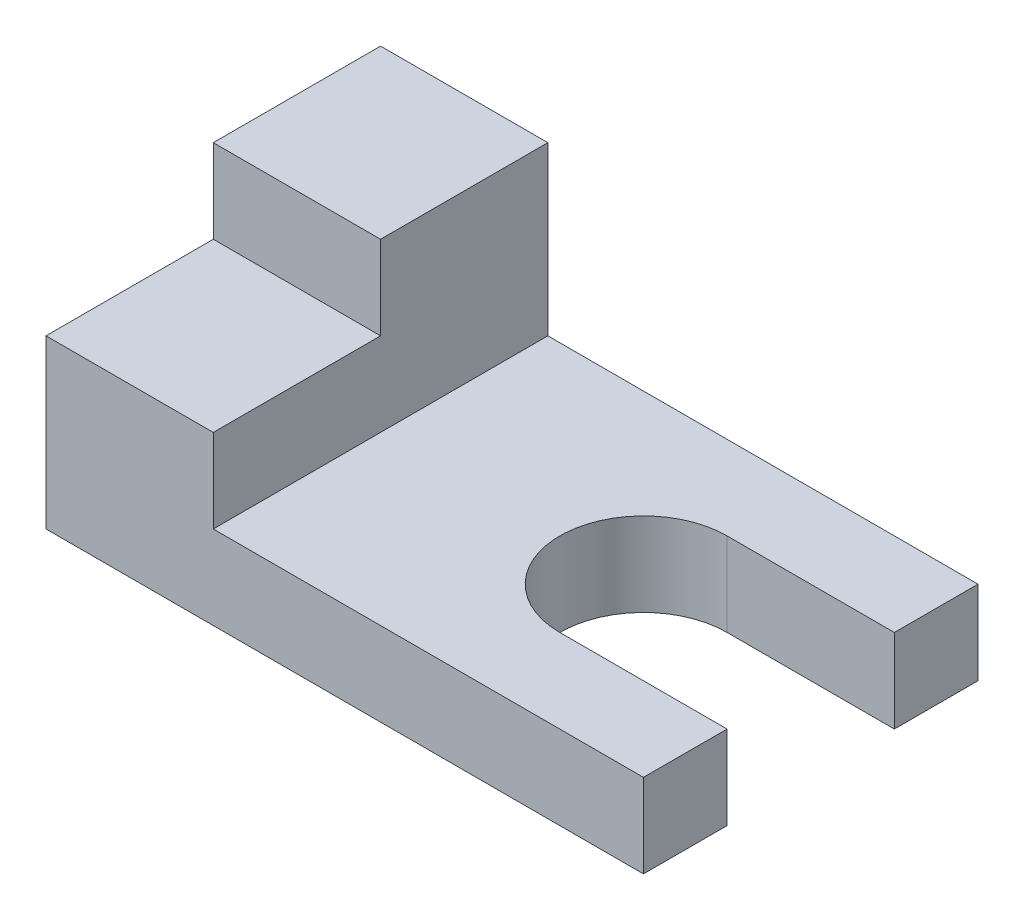
ISO-10303-21;
HEADER;
FILE_DESCRIPTION(('STEP AP214'),'2;1');
FILE_NAME('part.step','',(''),(''),'','','');
FILE_SCHEMA(('AUTOMOTIVE_DESIGN { 1 0 10303 214 1 1 1 1 }'));
ENDSEC;
DATA;
#1=APPLICATION_CONTEXT('core data for automotive mechanical design processes');
#2=APPLICATION_PROTOCOL_DEFINITION('international standard','automotive_design',2000,#1);
#3=PRODUCT_CONTEXT('',#1,'mechanical');
#4=PRODUCT('Part','Part','',(#3));
#5=PRODUCT_RELATED_PRODUCT_CATEGORY('part','',(#4));
#6=PRODUCT_DEFINITION_FORMATION('','',#4);
#7=PRODUCT_DEFINITION_CONTEXT('part definition',#1,'design');
#8=PRODUCT_DEFINITION('design','',#6,#7);
#9=PRODUCT_DEFINITION_SHAPE('','',#8);
#10=(LENGTH_UNIT() NAMED_UNIT(*) SI_UNIT(.MILLI.,.METRE.));
#11=(NAMED_UNIT(*) PLANE_ANGLE_UNIT() SI_UNIT($,.RADIAN.));
#12=(NAMED_UNIT(*) SI_UNIT($,.STERADIAN.) SOLID_ANGLE_UNIT());
#13=UNCERTAINTY_MEASURE_WITH_UNIT(LENGTH_MEASURE(1.E-05),#10,'distance_accuracy_value','');
#14=(GEOMETRIC_REPRESENTATION_CONTEXT(3) GLOBAL_UNCERTAINTY_ASSIGNED_CONTEXT((#13)) GLOBAL_UNIT_ASSIGNED_CONTEXT((#10,
#11,#12)) REPRESENTATION_CONTEXT('',''));
#15=CARTESIAN_POINT('',(0.,0.,0.));
#16=DIRECTION('',(0.,0.,1.));
#17=DIRECTION('',(1.,0.,0.));
#18=AXIS2_PLACEMENT_3D('',#15,#16,#17);
#19=CARTESIAN_POINT('',(0.,0.,28.));
#20=DIRECTION('',(0.,1.,0.));
#21=DIRECTION('',(0.,0.,1.));
#22=AXIS2_PLACEMENT_3D('',#19,#20,#21);
#23=PLANE('',#22);
#24=DIRECTION('',(1.,0.,0.));
#25=VECTOR('',#24,1.);
#26=CARTESIAN_POINT('',(50.,0.,21.));
#27=LINE('',#26,#25);
#28=CARTESIAN_POINT('',(36.,0.,21.));
#29=VERTEX_POINT('',#28);
#30=CARTESIAN_POINT('',(50.,0.,21.));
#31=VERTEX_POINT('',#30);
#32=EDGE_CURVE('E210',#29,#31,#27,.T.);
#33=ORIENTED_EDGE('',*,*,#32,.T.);
#34=DIRECTION('',(0.,0.,-1.));
#35=VECTOR('',#34,1.);
#36=CARTESIAN_POINT('',(50.,0.,28.));
#37=LINE('',#36,#35);
#38=CARTESIAN_POINT('',(50.,0.,28.));
#39=VERTEX_POINT('',#38);
#40=EDGE_CURVE('E41',#39,#31,#37,.T.);
#41=ORIENTED_EDGE('',*,*,#40,.F.);
#42=DIRECTION('',(1.,0.,0.));
#43=VECTOR('',#42,1.);
#44=CARTESIAN_POINT('',(0.,0.,28.));
#45=LINE('',#44,#43);
#46=CARTESIAN_POINT('',(0.,0.,28.));
#47=VERTEX_POINT('',#46);
#48=EDGE_CURVE('E184',#47,#39,#45,.T.);
#49=ORIENTED_EDGE('',*,*,#48,.F.);
#50=DIRECTION('',(0.,0.,-1.));
#51=VECTOR('',#50,1.);
#52=CARTESIAN_POINT('',(0.,0.,28.));
#53=LINE('',#52,#51);
#54=CARTESIAN_POINT('',(0.,0.,0.));
#55=VERTEX_POINT('',#54);
#56=EDGE_CURVE('E11',#47,#55,#53,.T.);
#57=ORIENTED_EDGE('',*,*,#56,.T.);
#58=DIRECTION('',(1.,0.,0.));
#59=VECTOR('',#58,1.);
#60=CARTESIAN_POINT('',(0.,0.,0.));
#61=LINE('',#60,#59);
#62=CARTESIAN_POINT('',(50.,0.,0.));
#63=VERTEX_POINT('',#62);
#64=EDGE_CURVE('E172',#55,#63,#61,.T.);
#65=ORIENTED_EDGE('',*,*,#64,.T.);
#66=CARTESIAN_POINT('',(50.,0.,7.));
#67=VERTEX_POINT('',#66);
#68=EDGE_CURVE('E148',#67,#63,#37,.T.);
#69=ORIENTED_EDGE('',*,*,#68,.F.);
#70=DIRECTION('',(-1.,0.,0.));
#71=VECTOR('',#70,1.);
#72=CARTESIAN_POINT('',(36.,0.,7.));
#73=LINE('',#72,#71);
#74=CARTESIAN_POINT('',(36.,0.,7.));
#75=VERTEX_POINT('',#74);
#76=EDGE_CURVE('E207',#67,#75,#73,.T.);
#77=ORIENTED_EDGE('',*,*,#76,.T.);
#78=CARTESIAN_POINT('',(36.,0.,14.));
#79=DIRECTION('',(0.,1.,0.));
#80=DIRECTION('',(0.,0.,1.));
#81=AXIS2_PLACEMENT_3D('',#78,#79,#80);
#82=CIRCLE('',#81,7.);
#83=EDGE_CURVE('E133',#75,#29,#82,.T.);
#84=ORIENTED_EDGE('',*,*,#83,.T.);
#85=EDGE_LOOP('',(#33,#41,#49,#57,#65,#69,#77,#84));
#86=FACE_BOUND('',#85,.T.);
#87=ADVANCED_FACE('F33',(#86),#23,.F.);
#88=CARTESIAN_POINT('',(50.,0.,28.));
#89=DIRECTION('',(-1.,0.,0.));
#90=DIRECTION('',(0.,0.,1.));
#91=AXIS2_PLACEMENT_3D('',#88,#89,#90);
#92=PLANE('',#91);
#93=DIRECTION('',(0.,-1.,0.));
#94=VECTOR('',#93,1.);
#95=CARTESIAN_POINT('',(50.,21.001,21.));
#96=LINE('',#95,#94);
#97=CARTESIAN_POINT('',(50.,7.,21.));
#98=VERTEX_POINT('',#97);
#99=EDGE_CURVE('E127',#98,#31,#96,.T.);
#100=ORIENTED_EDGE('',*,*,#99,.F.);
#101=DIRECTION('',(0.,0.,-1.));
#102=VECTOR('',#101,1.);
#103=CARTESIAN_POINT('',(50.,7.,28.));
#104=LINE('',#103,#102);
#105=CARTESIAN_POINT('',(50.,7.,28.));
#106=VERTEX_POINT('',#105);
#107=EDGE_CURVE('E141',#106,#98,#104,.T.);
#108=ORIENTED_EDGE('',*,*,#107,.F.);
#109=DIRECTION('',(0.,1.,0.));
#110=VECTOR('',#109,1.);
#111=CARTESIAN_POINT('',(50.,0.,28.));
#112=LINE('',#111,#110);
#113=EDGE_CURVE('E182',#39,#106,#112,.T.);
#114=ORIENTED_EDGE('',*,*,#113,.F.);
#115=ORIENTED_EDGE('',*,*,#40,.T.);
#116=EDGE_LOOP('',(#100,#108,#114,#115));
#117=FACE_BOUND('',#116,.T.);
#118=ADVANCED_FACE('F139',(#117),#92,.F.);
#119=DIRECTION('',(0.,-1.,0.));
#120=VECTOR('',#119,1.);
#121=CARTESIAN_POINT('',(50.,21.001,7.));
#122=LINE('',#121,#120);
#123=CARTESIAN_POINT('',(50.,7.,7.));
#124=VERTEX_POINT('',#123);
#125=EDGE_CURVE('E48',#124,#67,#122,.T.);
#126=ORIENTED_EDGE('',*,*,#125,.T.);
#127=ORIENTED_EDGE('',*,*,#68,.T.);
#128=DIRECTION('',(0.,1.,0.));
#129=VECTOR('',#128,1.);
#130=CARTESIAN_POINT('',(50.,0.,0.));
#131=LINE('',#130,#129);
#132=CARTESIAN_POINT('',(50.,7.,0.));
#133=VERTEX_POINT('',#132);
#134=EDGE_CURVE('E169',#63,#133,#131,.T.);
#135=ORIENTED_EDGE('',*,*,#134,.T.);
#136=EDGE_CURVE('E149',#124,#133,#104,.T.);
#137=ORIENTED_EDGE('',*,*,#136,.F.);
#138=EDGE_LOOP('',(#126,#127,#135,#137));
#139=FACE_BOUND('',#138,.T.);
#140=ADVANCED_FACE('F223',(#139),#92,.F.);
#141=CARTESIAN_POINT('',(14.,7.,28.));
#142=DIRECTION('',(0.,-1.,0.));
#143=DIRECTION('',(0.,0.,-1.));
#144=AXIS2_PLACEMENT_3D('',#141,#142,#143);
#145=PLANE('',#144);
#146=DIRECTION('',(-1.,0.,0.));
#147=VECTOR('',#146,1.);
#148=CARTESIAN_POINT('',(50.,7.,21.));
#149=LINE('',#148,#147);
#150=CARTESIAN_POINT('',(36.,7.,21.));
#151=VERTEX_POINT('',#150);
#152=EDGE_CURVE('E123',#98,#151,#149,.T.);
#153=ORIENTED_EDGE('',*,*,#152,.T.);
#154=CARTESIAN_POINT('',(36.,7.,14.));
#155=DIRECTION('',(0.,-1.,0.));
#156=DIRECTION('',(0.,0.,-1.));
#157=AXIS2_PLACEMENT_3D('',#154,#155,#156);
#158=CIRCLE('',#157,7.);
#159=CARTESIAN_POINT('',(36.,7.,7.));
#160=VERTEX_POINT('',#159);
#161=EDGE_CURVE('E134',#151,#160,#158,.T.);
#162=ORIENTED_EDGE('',*,*,#161,.T.);
#163=DIRECTION('',(1.,0.,0.));
#164=VECTOR('',#163,1.);
#165=CARTESIAN_POINT('',(36.,7.,7.));
#166=LINE('',#165,#164);
#167=EDGE_CURVE('E194',#160,#124,#166,.T.);
#168=ORIENTED_EDGE('',*,*,#167,.T.);
#169=ORIENTED_EDGE('',*,*,#136,.T.);
#170=DIRECTION('',(-1.,0.,0.));
#171=VECTOR('',#170,1.);
#172=CARTESIAN_POINT('',(14.,7.,0.));
#173=LINE('',#172,#171);
#174=CARTESIAN_POINT('',(14.,7.,0.));
#175=VERTEX_POINT('',#174);
#176=EDGE_CURVE('E167',#133,#175,#173,.T.);
#177=ORIENTED_EDGE('',*,*,#176,.T.);
#178=DIRECTION('',(0.,0.,-1.));
#179=VECTOR('',#178,1.);
#180=CARTESIAN_POINT('',(14.,7.,28.));
#181=LINE('',#180,#179);
#182=CARTESIAN_POINT('',(14.,7.,28.));
#183=VERTEX_POINT('',#182);
#184=EDGE_CURVE('E151',#183,#175,#181,.T.);
#185=ORIENTED_EDGE('',*,*,#184,.F.);
#186=DIRECTION('',(-1.,0.,0.));
#187=VECTOR('',#186,1.);
#188=CARTESIAN_POINT('',(14.,7.,28.));
#189=LINE('',#188,#187);
#190=EDGE_CURVE('E147',#106,#183,#189,.T.);
#191=ORIENTED_EDGE('',*,*,#190,.F.);
#192=ORIENTED_EDGE('',*,*,#107,.T.);
#193=EDGE_LOOP('',(#153,#162,#168,#169,#177,#185,#191,#192));
#194=FACE_BOUND('',#193,.T.);
#195=ADVANCED_FACE('F145',(#194),#145,.F.);
#196=CARTESIAN_POINT('',(0.,0.,28.));
#197=DIRECTION('',(0.,0.,-1.));
#198=DIRECTION('',(-1.,0.,0.));
#199=AXIS2_PLACEMENT_3D('',#196,#197,#198);
#200=PLANE('',#199);
#201=DIRECTION('',(1.,0.,0.));
#202=VECTOR('',#201,1.);
#203=CARTESIAN_POINT('',(0.,14.,28.));
#204=LINE('',#203,#202);
#205=CARTESIAN_POINT('',(0.,14.,28.));
#206=VERTEX_POINT('',#205);
#207=CARTESIAN_POINT('',(14.,14.,28.));
#208=VERTEX_POINT('',#207);
#209=EDGE_CURVE('E193',#206,#208,#204,.T.);
#210=ORIENTED_EDGE('',*,*,#209,.F.);
#211=DIRECTION('',(0.,-1.,0.));
#212=VECTOR('',#211,1.);
#213=CARTESIAN_POINT('',(0.,0.,28.));
#214=LINE('',#213,#212);
#215=EDGE_CURVE('E163',#206,#47,#214,.T.);
#216=ORIENTED_EDGE('',*,*,#215,.T.);
#217=ORIENTED_EDGE('',*,*,#48,.T.);
#218=ORIENTED_EDGE('',*,*,#113,.T.);
#219=ORIENTED_EDGE('',*,*,#190,.T.);
#220=DIRECTION('',(0.,1.,0.));
#221=VECTOR('',#220,1.);
#222=CARTESIAN_POINT('',(14.,7.,28.));
#223=LINE('',#222,#221);
#224=EDGE_CURVE('E159',#183,#208,#223,.T.);
#225=ORIENTED_EDGE('',*,*,#224,.T.);
#226=EDGE_LOOP('',(#210,#216,#217,#218,#219,#225));
#227=FACE_BOUND('',#226,.T.);
#228=ADVANCED_FACE('F240',(#227),#200,.F.);
#229=CARTESIAN_POINT('',(0.,0.,28.));
#230=DIRECTION('',(1.,0.,0.));
#231=DIRECTION('',(0.,0.,-1.));
#232=AXIS2_PLACEMENT_3D('',#229,#230,#231);
#233=PLANE('',#232);
#234=DIRECTION('',(0.,0.,1.));
#235=VECTOR('',#234,1.);
#236=CARTESIAN_POINT('',(0.,14.,14.));
#237=LINE('',#236,#235);
#238=CARTESIAN_POINT('',(0.,14.,14.));
#239=VERTEX_POINT('',#238);
#240=EDGE_CURVE('E56',#239,#206,#237,.T.);
#241=ORIENTED_EDGE('',*,*,#240,.F.);
#242=DIRECTION('',(0.,1.,0.));
#243=VECTOR('',#242,1.);
#244=CARTESIAN_POINT('',(0.,14.,14.));
#245=LINE('',#244,#243);
#246=CARTESIAN_POINT('',(0.,21.,14.));
#247=VERTEX_POINT('',#246);
#248=EDGE_CURVE('E178',#239,#247,#245,.T.);
#249=ORIENTED_EDGE('',*,*,#248,.T.);
#250=DIRECTION('',(0.,0.,-1.));
#251=VECTOR('',#250,1.);
#252=CARTESIAN_POINT('',(0.,21.,28.));
#253=LINE('',#252,#251);
#254=CARTESIAN_POINT('',(0.,21.,0.));
#255=VERTEX_POINT('',#254);
#256=EDGE_CURVE('E157',#247,#255,#253,.T.);
#257=ORIENTED_EDGE('',*,*,#256,.T.);
#258=DIRECTION('',(0.,-1.,0.));
#259=VECTOR('',#258,1.);
#260=CARTESIAN_POINT('',(0.,0.,0.));
#261=LINE('',#260,#259);
#262=EDGE_CURVE('E175',#255,#55,#261,.T.);
#263=ORIENTED_EDGE('',*,*,#262,.T.);
#264=ORIENTED_EDGE('',*,*,#56,.F.);
#265=ORIENTED_EDGE('',*,*,#215,.F.);
#266=EDGE_LOOP('',(#241,#249,#257,#263,#264,#265));
#267=FACE_BOUND('',#266,.T.);
#268=ADVANCED_FACE('F35',(#267),#233,.F.);
#269=CARTESIAN_POINT('',(14.,7.,28.));
#270=DIRECTION('',(-1.,0.,0.));
#271=DIRECTION('',(0.,0.,1.));
#272=AXIS2_PLACEMENT_3D('',#269,#270,#271);
#273=PLANE('',#272);
#274=DIRECTION('',(0.,0.,-1.));
#275=VECTOR('',#274,1.);
#276=CARTESIAN_POINT('',(14.,21.,28.));
#277=LINE('',#276,#275);
#278=CARTESIAN_POINT('',(14.,21.,14.));
#279=VERTEX_POINT('',#278);
#280=CARTESIAN_POINT('',(14.,21.,0.));
#281=VERTEX_POINT('',#280);
#282=EDGE_CURVE('E155',#279,#281,#277,.T.);
#283=ORIENTED_EDGE('',*,*,#282,.F.);
#284=DIRECTION('',(0.,1.,0.));
#285=VECTOR('',#284,1.);
#286=CARTESIAN_POINT('',(14.,14.,14.));
#287=LINE('',#286,#285);
#288=CARTESIAN_POINT('',(14.,14.,14.));
#289=VERTEX_POINT('',#288);
#290=EDGE_CURVE('E187',#289,#279,#287,.T.);
#291=ORIENTED_EDGE('',*,*,#290,.F.);
#292=DIRECTION('',(0.,0.,-1.));
#293=VECTOR('',#292,1.);
#294=CARTESIAN_POINT('',(14.,14.,28.));
#295=LINE('',#294,#293);
#296=EDGE_CURVE('E198',#208,#289,#295,.T.);
#297=ORIENTED_EDGE('',*,*,#296,.F.);
#298=ORIENTED_EDGE('',*,*,#224,.F.);
#299=ORIENTED_EDGE('',*,*,#184,.T.);
#300=DIRECTION('',(0.,1.,0.));
#301=VECTOR('',#300,1.);
#302=CARTESIAN_POINT('',(14.,7.,0.));
#303=LINE('',#302,#301);
#304=EDGE_CURVE('E164',#175,#281,#303,.T.);
#305=ORIENTED_EDGE('',*,*,#304,.T.);
#306=EDGE_LOOP('',(#283,#291,#297,#298,#299,#305));
#307=FACE_BOUND('',#306,.T.);
#308=ADVANCED_FACE('F236',(#307),#273,.F.);
#309=CARTESIAN_POINT('',(0.,21.,28.));
#310=DIRECTION('',(0.,-1.,0.));
#311=DIRECTION('',(0.,0.,-1.));
#312=AXIS2_PLACEMENT_3D('',#309,#310,#311);
#313=PLANE('',#312);
#314=ORIENTED_EDGE('',*,*,#256,.F.);
#315=DIRECTION('',(-1.,0.,0.));
#316=VECTOR('',#315,1.);
#317=CARTESIAN_POINT('',(14.,21.,14.));
#318=LINE('',#317,#316);
#319=EDGE_CURVE('E191',#279,#247,#318,.T.);
#320=ORIENTED_EDGE('',*,*,#319,.F.);
#321=ORIENTED_EDGE('',*,*,#282,.T.);
#322=DIRECTION('',(-1.,0.,0.));
#323=VECTOR('',#322,1.);
#324=CARTESIAN_POINT('',(0.,21.,0.));
#325=LINE('',#324,#323);
#326=EDGE_CURVE('E160',#281,#255,#325,.T.);
#327=ORIENTED_EDGE('',*,*,#326,.T.);
#328=EDGE_LOOP('',(#314,#320,#321,#327));
#329=FACE_BOUND('',#328,.T.);
#330=ADVANCED_FACE('F245',(#329),#313,.F.);
#331=CARTESIAN_POINT('',(0.,0.,0.));
#332=DIRECTION('',(0.,0.,-1.));
#333=DIRECTION('',(-1.,0.,0.));
#334=AXIS2_PLACEMENT_3D('',#331,#332,#333);
#335=PLANE('',#334);
#336=ORIENTED_EDGE('',*,*,#262,.F.);
#337=ORIENTED_EDGE('',*,*,#326,.F.);
#338=ORIENTED_EDGE('',*,*,#304,.F.);
#339=ORIENTED_EDGE('',*,*,#176,.F.);
#340=ORIENTED_EDGE('',*,*,#134,.F.);
#341=ORIENTED_EDGE('',*,*,#64,.F.);
#342=EDGE_LOOP('',(#336,#337,#338,#339,#340,#341));
#343=FACE_BOUND('',#342,.T.);
#344=ADVANCED_FACE('F230',(#343),#335,.T.);
#345=CARTESIAN_POINT('',(14.,14.,14.));
#346=DIRECTION('',(0.,0.,-1.));
#347=DIRECTION('',(-1.,0.,0.));
#348=AXIS2_PLACEMENT_3D('',#345,#346,#347);
#349=PLANE('',#348);
#350=ORIENTED_EDGE('',*,*,#319,.T.);
#351=ORIENTED_EDGE('',*,*,#248,.F.);
#352=DIRECTION('',(-1.,0.,0.));
#353=VECTOR('',#352,1.);
#354=CARTESIAN_POINT('',(14.,14.,14.));
#355=LINE('',#354,#353);
#356=EDGE_CURVE('E196',#289,#239,#355,.T.);
#357=ORIENTED_EDGE('',*,*,#356,.F.);
#358=ORIENTED_EDGE('',*,*,#290,.T.);
#359=EDGE_LOOP('',(#350,#351,#357,#358));
#360=FACE_BOUND('',#359,.T.);
#361=ADVANCED_FACE('F248',(#360),#349,.F.);
#362=CARTESIAN_POINT('',(0.,14.,0.));
#363=DIRECTION('',(0.,1.,0.));
#364=DIRECTION('',(0.,0.,1.));
#365=AXIS2_PLACEMENT_3D('',#362,#363,#364);
#366=PLANE('',#365);
#367=ORIENTED_EDGE('',*,*,#209,.T.);
#368=ORIENTED_EDGE('',*,*,#296,.T.);
#369=ORIENTED_EDGE('',*,*,#356,.T.);
#370=ORIENTED_EDGE('',*,*,#240,.T.);
#371=EDGE_LOOP('',(#367,#368,#369,#370));
#372=FACE_BOUND('',#371,.T.);
#373=ADVANCED_FACE('F249',(#372),#366,.T.);
#374=CARTESIAN_POINT('',(36.,21.001,14.));
#375=DIRECTION('',(0.,-1.,0.));
#376=DIRECTION('',(0.,0.,-1.));
#377=AXIS2_PLACEMENT_3D('',#374,#375,#376);
#378=CYLINDRICAL_SURFACE('',#377,7.);
#379=DIRECTION('',(0.,-1.,0.));
#380=VECTOR('',#379,1.);
#381=CARTESIAN_POINT('',(36.,21.001,21.));
#382=LINE('',#381,#380);
#383=EDGE_CURVE('E129',#151,#29,#382,.T.);
#384=ORIENTED_EDGE('',*,*,#383,.T.);
#385=ORIENTED_EDGE('',*,*,#83,.F.);
#386=DIRECTION('',(0.,-1.,0.));
#387=VECTOR('',#386,1.);
#388=CARTESIAN_POINT('',(36.,21.001,7.));
#389=LINE('',#388,#387);
#390=EDGE_CURVE('E205',#160,#75,#389,.T.);
#391=ORIENTED_EDGE('',*,*,#390,.F.);
#392=ORIENTED_EDGE('',*,*,#161,.F.);
#393=EDGE_LOOP('',(#384,#385,#391,#392));
#394=FACE_BOUND('',#393,.T.);
#395=ADVANCED_FACE('F217',(#394),#378,.F.);
#396=CARTESIAN_POINT('',(50.,21.001,21.));
#397=DIRECTION('',(0.,0.,-1.));
#398=DIRECTION('',(-1.,0.,0.));
#399=AXIS2_PLACEMENT_3D('',#396,#397,#398);
#400=PLANE('',#399);
#401=ORIENTED_EDGE('',*,*,#99,.T.);
#402=ORIENTED_EDGE('',*,*,#32,.F.);
#403=ORIENTED_EDGE('',*,*,#383,.F.);
#404=ORIENTED_EDGE('',*,*,#152,.F.);
#405=EDGE_LOOP('',(#401,#402,#403,#404));
#406=FACE_BOUND('',#405,.T.);
#407=ADVANCED_FACE('F125',(#406),#400,.T.);
#408=CARTESIAN_POINT('',(36.,21.001,7.));
#409=DIRECTION('',(0.,0.,1.));
#410=DIRECTION('',(1.,0.,0.));
#411=AXIS2_PLACEMENT_3D('',#408,#409,#410);
#412=PLANE('',#411);
#413=ORIENTED_EDGE('',*,*,#390,.T.);
#414=ORIENTED_EDGE('',*,*,#76,.F.);
#415=ORIENTED_EDGE('',*,*,#125,.F.);
#416=ORIENTED_EDGE('',*,*,#167,.F.);
#417=EDGE_LOOP('',(#413,#414,#415,#416));
#418=FACE_BOUND('',#417,.T.);
#419=ADVANCED_FACE('F219',(#418),#412,.T.);
#420=CLOSED_SHELL('',(#87,#118,#140,#195,#228,#268,#308,#330,#344,#361,#373,#395,#407,#419));
#421=MANIFOLD_SOLID_BREP('B2',#420);
#422=ADVANCED_BREP_SHAPE_REPRESENTATION('',(#18,#421),#14);
#423=SHAPE_DEFINITION_REPRESENTATION(#9,#422);
ENDSEC;
END-ISO-10303-21;
